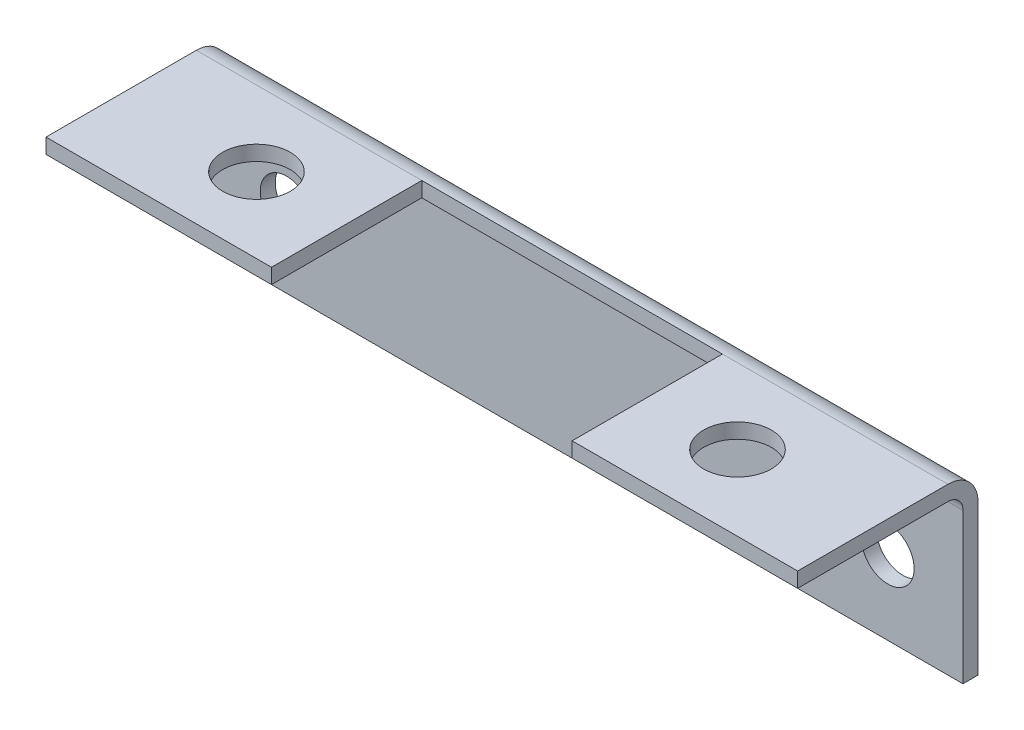
ISO-10303-21;
HEADER;
FILE_DESCRIPTION(('STEP AP214'),'2;1');
FILE_NAME('part.step','',(''),(''),'','','');
FILE_SCHEMA(('AUTOMOTIVE_DESIGN { 1 0 10303 214 1 1 1 1 }'));
ENDSEC;
DATA;
#1=APPLICATION_CONTEXT('core data for automotive mechanical design processes');
#2=APPLICATION_PROTOCOL_DEFINITION('international standard','automotive_design',2000,#1);
#3=PRODUCT_CONTEXT('',#1,'mechanical');
#4=PRODUCT('Part','Part','',(#3));
#5=PRODUCT_RELATED_PRODUCT_CATEGORY('part','',(#4));
#6=PRODUCT_DEFINITION_FORMATION('','',#4);
#7=PRODUCT_DEFINITION_CONTEXT('part definition',#1,'design');
#8=PRODUCT_DEFINITION('design','',#6,#7);
#9=PRODUCT_DEFINITION_SHAPE('','',#8);
#10=(LENGTH_UNIT() NAMED_UNIT(*) SI_UNIT(.MILLI.,.METRE.));
#11=(NAMED_UNIT(*) PLANE_ANGLE_UNIT() SI_UNIT($,.RADIAN.));
#12=(NAMED_UNIT(*) SI_UNIT($,.STERADIAN.) SOLID_ANGLE_UNIT());
#13=UNCERTAINTY_MEASURE_WITH_UNIT(LENGTH_MEASURE(1.E-05),#10,'distance_accuracy_value','');
#14=(GEOMETRIC_REPRESENTATION_CONTEXT(3) GLOBAL_UNCERTAINTY_ASSIGNED_CONTEXT((#13)) GLOBAL_UNIT_ASSIGNED_CONTEXT((#10,
#11,#12)) REPRESENTATION_CONTEXT('',''));
#15=CARTESIAN_POINT('',(0.,0.,0.));
#16=DIRECTION('',(0.,0.,1.));
#17=DIRECTION('',(1.,0.,0.));
#18=AXIS2_PLACEMENT_3D('',#15,#16,#17);
#19=CARTESIAN_POINT('',(0.,6.00000000000001,5.86902664470767));
#20=DIRECTION('',(0.,-1.,0.));
#21=DIRECTION('',(0.,0.,-1.));
#22=AXIS2_PLACEMENT_3D('',#19,#20,#21);
#23=PLANE('',#22);
#24=CARTESIAN_POINT('',(16.,6.00000000000001,7.));
#25=DIRECTION('',(0.,1.,0.));
#26=DIRECTION('',(0.,0.,1.));
#27=AXIS2_PLACEMENT_3D('',#24,#25,#26);
#28=CIRCLE('',#27,2.25);
#29=CARTESIAN_POINT('',(16.,6.00000000000001,9.25));
#30=VERTEX_POINT('',#29);
#31=EDGE_CURVE('E19',#30,#30,#28,.T.);
#32=ORIENTED_EDGE('',*,*,#31,.T.);
#33=EDGE_LOOP('',(#32));
#34=FACE_BOUND('',#33,.T.);
#35=DIRECTION('',(0.,0.,-1.));
#36=VECTOR('',#35,1.);
#37=CARTESIAN_POINT('',(25.,6.00000000000001,2.));
#38=LINE('',#37,#36);
#39=CARTESIAN_POINT('',(25.,6.00000000000001,12.));
#40=VERTEX_POINT('',#39);
#41=CARTESIAN_POINT('',(25.,6.00000000000001,2.));
#42=VERTEX_POINT('',#41);
#43=EDGE_CURVE('E59',#40,#42,#38,.T.);
#44=ORIENTED_EDGE('',*,*,#43,.F.);
#45=DIRECTION('',(1.,0.,0.));
#46=VECTOR('',#45,1.);
#47=CARTESIAN_POINT('',(25.,6.00000000000001,12.));
#48=LINE('',#47,#46);
#49=CARTESIAN_POINT('',(10.,6.00000000000001,12.));
#50=VERTEX_POINT('',#49);
#51=EDGE_CURVE('E68',#50,#40,#48,.T.);
#52=ORIENTED_EDGE('',*,*,#51,.F.);
#53=DIRECTION('',(0.,0.,-1.));
#54=VECTOR('',#53,1.);
#55=CARTESIAN_POINT('',(10.,6.00000000000001,2.));
#56=LINE('',#55,#54);
#57=CARTESIAN_POINT('',(10.,6.00000000000001,2.));
#58=VERTEX_POINT('',#57);
#59=EDGE_CURVE('E247',#50,#58,#56,.T.);
#60=ORIENTED_EDGE('',*,*,#59,.T.);
#61=DIRECTION('',(1.,0.,0.));
#62=VECTOR('',#61,1.);
#63=CARTESIAN_POINT('',(0.,6.00000000000001,2.));
#64=LINE('',#63,#62);
#65=EDGE_CURVE('E235',#58,#42,#64,.T.);
#66=ORIENTED_EDGE('',*,*,#65,.T.);
#67=EDGE_LOOP('',(#44,#52,#60,#66));
#68=FACE_BOUND('',#67,.T.);
#69=ADVANCED_FACE('F16',(#34,#68),#23,.T.);
#70=CARTESIAN_POINT('',(0.,6.00000000000001,5.86902664470767));
#71=DIRECTION('',(0.,-1.,0.));
#72=DIRECTION('',(0.,0.,-1.));
#73=AXIS2_PLACEMENT_3D('',#70,#71,#72);
#74=PLANE('',#73);
#75=CARTESIAN_POINT('',(-16.,6.00000000000001,7.));
#76=DIRECTION('',(0.,1.,0.));
#77=DIRECTION('',(0.,0.,1.));
#78=AXIS2_PLACEMENT_3D('',#75,#76,#77);
#79=CIRCLE('',#78,2.25);
#80=CARTESIAN_POINT('',(-16.,6.00000000000001,9.25));
#81=VERTEX_POINT('',#80);
#82=EDGE_CURVE('E224',#81,#81,#79,.T.);
#83=ORIENTED_EDGE('',*,*,#82,.T.);
#84=EDGE_LOOP('',(#83));
#85=FACE_BOUND('',#84,.T.);
#86=DIRECTION('',(0.,0.,1.));
#87=VECTOR('',#86,1.);
#88=CARTESIAN_POINT('',(-25.,6.00000000000001,2.));
#89=LINE('',#88,#87);
#90=CARTESIAN_POINT('',(-25.,6.00000000000001,2.));
#91=VERTEX_POINT('',#90);
#92=CARTESIAN_POINT('',(-25.,6.00000000000001,12.));
#93=VERTEX_POINT('',#92);
#94=EDGE_CURVE('E214',#91,#93,#89,.T.);
#95=ORIENTED_EDGE('',*,*,#94,.F.);
#96=DIRECTION('',(1.,0.,0.));
#97=VECTOR('',#96,1.);
#98=CARTESIAN_POINT('',(0.,6.00000000000001,2.));
#99=LINE('',#98,#97);
#100=CARTESIAN_POINT('',(-10.,6.00000000000001,2.));
#101=VERTEX_POINT('',#100);
#102=EDGE_CURVE('E181',#91,#101,#99,.T.);
#103=ORIENTED_EDGE('',*,*,#102,.T.);
#104=DIRECTION('',(0.,0.,1.));
#105=VECTOR('',#104,1.);
#106=CARTESIAN_POINT('',(-10.,6.00000000000001,12.));
#107=LINE('',#106,#105);
#108=CARTESIAN_POINT('',(-10.,6.00000000000001,12.));
#109=VERTEX_POINT('',#108);
#110=EDGE_CURVE('E225',#101,#109,#107,.T.);
#111=ORIENTED_EDGE('',*,*,#110,.T.);
#112=DIRECTION('',(1.,0.,0.));
#113=VECTOR('',#112,1.);
#114=CARTESIAN_POINT('',(25.,6.00000000000001,12.));
#115=LINE('',#114,#113);
#116=EDGE_CURVE('E118',#93,#109,#115,.T.);
#117=ORIENTED_EDGE('',*,*,#116,.F.);
#118=EDGE_LOOP('',(#95,#103,#111,#117));
#119=FACE_BOUND('',#118,.T.);
#120=ADVANCED_FACE('F301',(#85,#119),#74,.T.);
#121=CARTESIAN_POINT('',(25.,6.00000000000001,12.));
#122=DIRECTION('',(0.,0.,1.));
#123=DIRECTION('',(0.,-1.,0.));
#124=AXIS2_PLACEMENT_3D('',#121,#122,#123);
#125=PLANE('',#124);
#126=DIRECTION('',(0.,-1.,0.));
#127=VECTOR('',#126,1.);
#128=CARTESIAN_POINT('',(25.,6.00000000000001,12.));
#129=LINE('',#128,#127);
#130=CARTESIAN_POINT('',(25.,7.00000000000001,12.));
#131=VERTEX_POINT('',#130);
#132=EDGE_CURVE('E111',#40,#131,#129,.F.);
#133=ORIENTED_EDGE('',*,*,#132,.T.);
#134=DIRECTION('',(1.,0.,0.));
#135=VECTOR('',#134,1.);
#136=CARTESIAN_POINT('',(0.,7.00000000000001,12.));
#137=LINE('',#136,#135);
#138=CARTESIAN_POINT('',(10.,7.00000000000001,12.));
#139=VERTEX_POINT('',#138);
#140=EDGE_CURVE('E180',#131,#139,#137,.F.);
#141=ORIENTED_EDGE('',*,*,#140,.T.);
#142=DIRECTION('',(0.,1.,0.));
#143=VECTOR('',#142,1.);
#144=CARTESIAN_POINT('',(10.,7.00000000000001,12.));
#145=LINE('',#144,#143);
#146=EDGE_CURVE('E250',#139,#50,#145,.F.);
#147=ORIENTED_EDGE('',*,*,#146,.T.);
#148=ORIENTED_EDGE('',*,*,#51,.T.);
#149=EDGE_LOOP('',(#133,#141,#147,#148));
#150=FACE_BOUND('',#149,.T.);
#151=ADVANCED_FACE('F378',(#150),#125,.T.);
#152=CARTESIAN_POINT('',(10.,7.00000000000001,2.));
#153=DIRECTION('',(1.,0.,0.));
#154=DIRECTION('',(0.,0.,-1.));
#155=AXIS2_PLACEMENT_3D('',#152,#153,#154);
#156=PLANE('',#155);
#157=DIRECTION('',(0.,1.,0.));
#158=VECTOR('',#157,1.);
#159=CARTESIAN_POINT('',(10.,7.00000000000001,2.));
#160=LINE('',#159,#158);
#161=CARTESIAN_POINT('',(10.,7.00000000000001,2.));
#162=VERTEX_POINT('',#161);
#163=EDGE_CURVE('E98',#58,#162,#160,.T.);
#164=ORIENTED_EDGE('',*,*,#163,.F.);
#165=ORIENTED_EDGE('',*,*,#59,.F.);
#166=ORIENTED_EDGE('',*,*,#146,.F.);
#167=DIRECTION('',(0.,0.,-1.));
#168=VECTOR('',#167,1.);
#169=CARTESIAN_POINT('',(10.,7.00000000000001,5.86902664470767));
#170=LINE('',#169,#168);
#171=EDGE_CURVE('E184',#139,#162,#170,.T.);
#172=ORIENTED_EDGE('',*,*,#171,.T.);
#173=EDGE_LOOP('',(#164,#165,#166,#172));
#174=FACE_BOUND('',#173,.T.);
#175=ADVANCED_FACE('F377',(#174),#156,.F.);
#176=CARTESIAN_POINT('',(16.,6.00000000000001,7.));
#177=DIRECTION('',(0.,1.,0.));
#178=DIRECTION('',(0.,0.,1.));
#179=AXIS2_PLACEMENT_3D('',#176,#177,#178);
#180=CYLINDRICAL_SURFACE('',#179,2.25);
#181=CARTESIAN_POINT('',(16.,7.00000000000001,7.));
#182=DIRECTION('',(0.,1.,0.));
#183=DIRECTION('',(0.,0.,1.));
#184=AXIS2_PLACEMENT_3D('',#181,#182,#183);
#185=CIRCLE('',#184,2.25);
#186=CARTESIAN_POINT('',(16.,7.00000000000001,9.25));
#187=VERTEX_POINT('',#186);
#188=EDGE_CURVE('E186',#187,#187,#185,.T.);
#189=ORIENTED_EDGE('',*,*,#188,.T.);
#190=EDGE_LOOP('',(#189));
#191=FACE_BOUND('',#190,.T.);
#192=ORIENTED_EDGE('',*,*,#31,.F.);
#193=EDGE_LOOP('',(#192));
#194=FACE_BOUND('',#193,.T.);
#195=ADVANCED_FACE('F385',(#191,#194),#180,.F.);
#196=CARTESIAN_POINT('',(25.,6.00000000000001,12.));
#197=DIRECTION('',(0.,0.,1.));
#198=DIRECTION('',(0.,-1.,0.));
#199=AXIS2_PLACEMENT_3D('',#196,#197,#198);
#200=PLANE('',#199);
#201=DIRECTION('',(0.,1.,0.));
#202=VECTOR('',#201,1.);
#203=CARTESIAN_POINT('',(-25.,6.00000000000001,12.));
#204=LINE('',#203,#202);
#205=CARTESIAN_POINT('',(-25.,7.00000000000001,12.));
#206=VERTEX_POINT('',#205);
#207=EDGE_CURVE('E211',#93,#206,#204,.T.);
#208=ORIENTED_EDGE('',*,*,#207,.F.);
#209=ORIENTED_EDGE('',*,*,#116,.T.);
#210=DIRECTION('',(0.,1.,0.));
#211=VECTOR('',#210,1.);
#212=CARTESIAN_POINT('',(-10.,7.00000000000001,12.));
#213=LINE('',#212,#211);
#214=CARTESIAN_POINT('',(-10.,7.00000000000001,12.));
#215=VERTEX_POINT('',#214);
#216=EDGE_CURVE('E222',#109,#215,#213,.T.);
#217=ORIENTED_EDGE('',*,*,#216,.T.);
#218=DIRECTION('',(1.,0.,0.));
#219=VECTOR('',#218,1.);
#220=CARTESIAN_POINT('',(0.,7.00000000000001,12.));
#221=LINE('',#220,#219);
#222=EDGE_CURVE('E165',#215,#206,#221,.F.);
#223=ORIENTED_EDGE('',*,*,#222,.T.);
#224=EDGE_LOOP('',(#208,#209,#217,#223));
#225=FACE_BOUND('',#224,.T.);
#226=ADVANCED_FACE('F318',(#225),#200,.T.);
#227=CARTESIAN_POINT('',(-10.,7.00000000000001,12.));
#228=DIRECTION('',(-1.,0.,0.));
#229=DIRECTION('',(0.,0.,1.));
#230=AXIS2_PLACEMENT_3D('',#227,#228,#229);
#231=PLANE('',#230);
#232=ORIENTED_EDGE('',*,*,#216,.F.);
#233=ORIENTED_EDGE('',*,*,#110,.F.);
#234=DIRECTION('',(0.,1.,0.));
#235=VECTOR('',#234,1.);
#236=CARTESIAN_POINT('',(-10.,7.00000000000001,2.));
#237=LINE('',#236,#235);
#238=CARTESIAN_POINT('',(-10.,7.00000000000001,2.));
#239=VERTEX_POINT('',#238);
#240=EDGE_CURVE('E213',#239,#101,#237,.F.);
#241=ORIENTED_EDGE('',*,*,#240,.F.);
#242=DIRECTION('',(0.,0.,-1.));
#243=VECTOR('',#242,1.);
#244=CARTESIAN_POINT('',(-10.,7.00000000000001,5.86902664470767));
#245=LINE('',#244,#243);
#246=EDGE_CURVE('E164',#239,#215,#245,.F.);
#247=ORIENTED_EDGE('',*,*,#246,.T.);
#248=EDGE_LOOP('',(#232,#233,#241,#247));
#249=FACE_BOUND('',#248,.T.);
#250=ADVANCED_FACE('F307',(#249),#231,.F.);
#251=CARTESIAN_POINT('',(-16.,6.00000000000001,7.));
#252=DIRECTION('',(0.,1.,0.));
#253=DIRECTION('',(0.,0.,1.));
#254=AXIS2_PLACEMENT_3D('',#251,#252,#253);
#255=CYLINDRICAL_SURFACE('',#254,2.25);
#256=CARTESIAN_POINT('',(-16.,7.00000000000001,7.));
#257=DIRECTION('',(0.,1.,0.));
#258=DIRECTION('',(0.,0.,1.));
#259=AXIS2_PLACEMENT_3D('',#256,#257,#258);
#260=CIRCLE('',#259,2.25);
#261=CARTESIAN_POINT('',(-16.,7.00000000000001,9.25));
#262=VERTEX_POINT('',#261);
#263=EDGE_CURVE('E230',#262,#262,#260,.T.);
#264=ORIENTED_EDGE('',*,*,#263,.T.);
#265=EDGE_LOOP('',(#264));
#266=FACE_BOUND('',#265,.T.);
#267=ORIENTED_EDGE('',*,*,#82,.F.);
#268=EDGE_LOOP('',(#267));
#269=FACE_BOUND('',#268,.T.);
#270=ADVANCED_FACE('F304',(#266,#269),#255,.F.);
#271=CARTESIAN_POINT('',(0.,5.00000000000001,2.));
#272=DIRECTION('',(1.,0.,0.));
#273=DIRECTION('',(0.,0.,-1.));
#274=AXIS2_PLACEMENT_3D('',#271,#272,#273);
#275=CYLINDRICAL_SURFACE('',#274,0.999999999999999);
#276=CARTESIAN_POINT('',(-25.,5.00000000000001,2.));
#277=DIRECTION('',(1.,0.,0.));
#278=DIRECTION('',(0.,0.,-1.));
#279=AXIS2_PLACEMENT_3D('',#276,#277,#278);
#280=CIRCLE('',#279,0.999999999999999);
#281=CARTESIAN_POINT('',(-25.,5.00000000000001,1.));
#282=VERTEX_POINT('',#281);
#283=EDGE_CURVE('E219',#282,#91,#280,.T.);
#284=ORIENTED_EDGE('',*,*,#283,.F.);
#285=DIRECTION('',(1.,0.,0.));
#286=VECTOR('',#285,1.);
#287=CARTESIAN_POINT('',(0.,5.00000000000001,1.));
#288=LINE('',#287,#286);
#289=CARTESIAN_POINT('',(25.,5.00000000000001,1.));
#290=VERTEX_POINT('',#289);
#291=EDGE_CURVE('E196',#290,#282,#288,.F.);
#292=ORIENTED_EDGE('',*,*,#291,.F.);
#293=CARTESIAN_POINT('',(25.,5.00000000000001,2.));
#294=DIRECTION('',(1.,0.,0.));
#295=DIRECTION('',(0.,0.,-1.));
#296=AXIS2_PLACEMENT_3D('',#293,#294,#295);
#297=CIRCLE('',#296,0.999999999999999);
#298=EDGE_CURVE('E295',#42,#290,#297,.F.);
#299=ORIENTED_EDGE('',*,*,#298,.F.);
#300=ORIENTED_EDGE('',*,*,#65,.F.);
#301=DIRECTION('',(-1.,0.,0.));
#302=VECTOR('',#301,1.);
#303=CARTESIAN_POINT('',(-10.,6.00000000000001,2.));
#304=LINE('',#303,#302);
#305=EDGE_CURVE('E199',#58,#101,#304,.T.);
#306=ORIENTED_EDGE('',*,*,#305,.T.);
#307=ORIENTED_EDGE('',*,*,#102,.F.);
#308=EDGE_LOOP('',(#284,#292,#299,#300,#306,#307));
#309=FACE_BOUND('',#308,.T.);
#310=ADVANCED_FACE('F306',(#309),#275,.F.);
#311=CARTESIAN_POINT('',(0.,7.00000000000001,5.86902664470767));
#312=DIRECTION('',(0.,-1.,0.));
#313=DIRECTION('',(0.,0.,-1.));
#314=AXIS2_PLACEMENT_3D('',#311,#312,#313);
#315=PLANE('',#314);
#316=ORIENTED_EDGE('',*,*,#188,.F.);
#317=EDGE_LOOP('',(#316));
#318=FACE_BOUND('',#317,.T.);
#319=ORIENTED_EDGE('',*,*,#140,.F.);
#320=DIRECTION('',(0.,0.,-1.));
#321=VECTOR('',#320,1.);
#322=CARTESIAN_POINT('',(25.,7.00000000000001,5.86902664470767));
#323=LINE('',#322,#321);
#324=CARTESIAN_POINT('',(25.,7.00000000000001,2.));
#325=VERTEX_POINT('',#324);
#326=EDGE_CURVE('E90',#325,#131,#323,.F.);
#327=ORIENTED_EDGE('',*,*,#326,.F.);
#328=DIRECTION('',(1.,0.,0.));
#329=VECTOR('',#328,1.);
#330=CARTESIAN_POINT('',(0.,7.00000000000001,2.));
#331=LINE('',#330,#329);
#332=EDGE_CURVE('E173',#162,#325,#331,.T.);
#333=ORIENTED_EDGE('',*,*,#332,.F.);
#334=ORIENTED_EDGE('',*,*,#171,.F.);
#335=EDGE_LOOP('',(#319,#327,#333,#334));
#336=FACE_BOUND('',#335,.T.);
#337=ADVANCED_FACE('F315',(#318,#336),#315,.F.);
#338=CARTESIAN_POINT('',(0.,7.00000000000001,5.86902664470767));
#339=DIRECTION('',(0.,-1.,0.));
#340=DIRECTION('',(0.,0.,-1.));
#341=AXIS2_PLACEMENT_3D('',#338,#339,#340);
#342=PLANE('',#341);
#343=ORIENTED_EDGE('',*,*,#263,.F.);
#344=EDGE_LOOP('',(#343));
#345=FACE_BOUND('',#344,.T.);
#346=DIRECTION('',(1.,0.,0.));
#347=VECTOR('',#346,1.);
#348=CARTESIAN_POINT('',(0.,7.00000000000001,2.));
#349=LINE('',#348,#347);
#350=CARTESIAN_POINT('',(-25.,7.00000000000001,2.));
#351=VERTEX_POINT('',#350);
#352=EDGE_CURVE('E168',#351,#239,#349,.T.);
#353=ORIENTED_EDGE('',*,*,#352,.F.);
#354=DIRECTION('',(0.,0.,-1.));
#355=VECTOR('',#354,1.);
#356=CARTESIAN_POINT('',(-25.,7.00000000000001,5.86902664470767));
#357=LINE('',#356,#355);
#358=EDGE_CURVE('E162',#206,#351,#357,.T.);
#359=ORIENTED_EDGE('',*,*,#358,.F.);
#360=ORIENTED_EDGE('',*,*,#222,.F.);
#361=ORIENTED_EDGE('',*,*,#246,.F.);
#362=EDGE_LOOP('',(#353,#359,#360,#361));
#363=FACE_BOUND('',#362,.T.);
#364=ADVANCED_FACE('F354',(#345,#363),#342,.F.);
#365=CARTESIAN_POINT('',(-10.,7.00000000000001,2.));
#366=DIRECTION('',(0.,0.,-1.));
#367=DIRECTION('',(-1.,0.,0.));
#368=AXIS2_PLACEMENT_3D('',#365,#366,#367);
#369=PLANE('',#368);
#370=ORIENTED_EDGE('',*,*,#240,.T.);
#371=ORIENTED_EDGE('',*,*,#305,.F.);
#372=ORIENTED_EDGE('',*,*,#163,.T.);
#373=DIRECTION('',(1.,0.,0.));
#374=VECTOR('',#373,1.);
#375=CARTESIAN_POINT('',(0.,7.00000000000001,2.));
#376=LINE('',#375,#374);
#377=EDGE_CURVE('E170',#239,#162,#376,.T.);
#378=ORIENTED_EDGE('',*,*,#377,.F.);
#379=EDGE_LOOP('',(#370,#371,#372,#378));
#380=FACE_BOUND('',#379,.T.);
#381=ADVANCED_FACE('F350',(#380),#369,.F.);
#382=CARTESIAN_POINT('',(0.,0.,1.));
#383=DIRECTION('',(0.,0.,1.));
#384=DIRECTION('',(1.,0.,0.));
#385=AXIS2_PLACEMENT_3D('',#382,#383,#384);
#386=PLANE('',#385);
#387=CARTESIAN_POINT('',(-20.,0.,1.));
#388=DIRECTION('',(0.,0.,1.));
#389=DIRECTION('',(1.,0.,0.));
#390=AXIS2_PLACEMENT_3D('',#387,#388,#389);
#391=CIRCLE('',#390,1.75);
#392=CARTESIAN_POINT('',(-18.25,0.,1.));
#393=VERTEX_POINT('',#392);
#394=EDGE_CURVE('E154',#393,#393,#391,.F.);
#395=ORIENTED_EDGE('',*,*,#394,.T.);
#396=EDGE_LOOP('',(#395));
#397=FACE_BOUND('',#396,.T.);
#398=CARTESIAN_POINT('',(20.,0.,1.));
#399=DIRECTION('',(0.,0.,1.));
#400=DIRECTION('',(1.,0.,0.));
#401=AXIS2_PLACEMENT_3D('',#398,#399,#400);
#402=CIRCLE('',#401,1.75);
#403=CARTESIAN_POINT('',(21.75,0.,1.));
#404=VERTEX_POINT('',#403);
#405=EDGE_CURVE('E157',#404,#404,#402,.F.);
#406=ORIENTED_EDGE('',*,*,#405,.T.);
#407=EDGE_LOOP('',(#406));
#408=FACE_BOUND('',#407,.T.);
#409=DIRECTION('',(0.,1.,0.));
#410=VECTOR('',#409,1.);
#411=CARTESIAN_POINT('',(-25.,-5.,1.));
#412=LINE('',#411,#410);
#413=CARTESIAN_POINT('',(-25.,-5.,1.));
#414=VERTEX_POINT('',#413);
#415=EDGE_CURVE('E198',#414,#282,#412,.T.);
#416=ORIENTED_EDGE('',*,*,#415,.F.);
#417=DIRECTION('',(1.,0.,0.));
#418=VECTOR('',#417,1.);
#419=CARTESIAN_POINT('',(25.,-4.99999999999999,1.));
#420=LINE('',#419,#418);
#421=CARTESIAN_POINT('',(25.,-4.99999999999999,1.));
#422=VERTEX_POINT('',#421);
#423=EDGE_CURVE('E139',#422,#414,#420,.F.);
#424=ORIENTED_EDGE('',*,*,#423,.F.);
#425=DIRECTION('',(0.,1.,0.));
#426=VECTOR('',#425,1.);
#427=CARTESIAN_POINT('',(25.,5.00000000000001,1.));
#428=LINE('',#427,#426);
#429=EDGE_CURVE('E144',#290,#422,#428,.F.);
#430=ORIENTED_EDGE('',*,*,#429,.F.);
#431=ORIENTED_EDGE('',*,*,#291,.T.);
#432=EDGE_LOOP('',(#416,#424,#430,#431));
#433=FACE_BOUND('',#432,.T.);
#434=ADVANCED_FACE('F347',(#397,#408,#433),#386,.T.);
#435=CARTESIAN_POINT('',(-25.,-5.,0.));
#436=DIRECTION('',(-1.,0.,0.));
#437=DIRECTION('',(0.,0.,1.));
#438=AXIS2_PLACEMENT_3D('',#435,#436,#437);
#439=PLANE('',#438);
#440=DIRECTION('',(0.,1.,0.));
#441=VECTOR('',#440,1.);
#442=CARTESIAN_POINT('',(-25.,0.,0.));
#443=LINE('',#442,#441);
#444=CARTESIAN_POINT('',(-25.,5.00000000000001,0.));
#445=VERTEX_POINT('',#444);
#446=CARTESIAN_POINT('',(-25.,-5.,0.));
#447=VERTEX_POINT('',#446);
#448=EDGE_CURVE('E149',#445,#447,#443,.F.);
#449=ORIENTED_EDGE('',*,*,#448,.T.);
#450=DIRECTION('',(0.,0.,1.));
#451=VECTOR('',#450,1.);
#452=CARTESIAN_POINT('',(-25.,-5.,0.));
#453=LINE('',#452,#451);
#454=EDGE_CURVE('E133',#414,#447,#453,.F.);
#455=ORIENTED_EDGE('',*,*,#454,.F.);
#456=ORIENTED_EDGE('',*,*,#415,.T.);
#457=ORIENTED_EDGE('',*,*,#283,.T.);
#458=ORIENTED_EDGE('',*,*,#94,.T.);
#459=ORIENTED_EDGE('',*,*,#207,.T.);
#460=ORIENTED_EDGE('',*,*,#358,.T.);
#461=CARTESIAN_POINT('',(-25.,5.00000000000001,2.));
#462=DIRECTION('',(1.,0.,0.));
#463=DIRECTION('',(0.,0.,-1.));
#464=AXIS2_PLACEMENT_3D('',#461,#462,#463);
#465=CIRCLE('',#464,2.);
#466=EDGE_CURVE('E80',#445,#351,#465,.T.);
#467=ORIENTED_EDGE('',*,*,#466,.F.);
#468=EDGE_LOOP('',(#449,#455,#456,#457,#458,#459,#460,#467));
#469=FACE_BOUND('',#468,.T.);
#470=ADVANCED_FACE('F153',(#469),#439,.T.);
#471=CARTESIAN_POINT('',(25.,-4.99999999999999,0.));
#472=DIRECTION('',(0.,-1.,0.));
#473=DIRECTION('',(1.,0.,0.));
#474=AXIS2_PLACEMENT_3D('',#471,#472,#473);
#475=PLANE('',#474);
#476=DIRECTION('',(1.,0.,0.));
#477=VECTOR('',#476,1.);
#478=CARTESIAN_POINT('',(0.,-5.,0.));
#479=LINE('',#478,#477);
#480=CARTESIAN_POINT('',(25.,-4.99999999999999,0.));
#481=VERTEX_POINT('',#480);
#482=EDGE_CURVE('E137',#447,#481,#479,.T.);
#483=ORIENTED_EDGE('',*,*,#482,.T.);
#484=DIRECTION('',(0.,0.,-1.));
#485=VECTOR('',#484,1.);
#486=CARTESIAN_POINT('',(25.,-4.99999999999999,0.));
#487=LINE('',#486,#485);
#488=EDGE_CURVE('E175',#422,#481,#487,.T.);
#489=ORIENTED_EDGE('',*,*,#488,.F.);
#490=ORIENTED_EDGE('',*,*,#423,.T.);
#491=ORIENTED_EDGE('',*,*,#454,.T.);
#492=EDGE_LOOP('',(#483,#489,#490,#491));
#493=FACE_BOUND('',#492,.T.);
#494=ADVANCED_FACE('F135',(#493),#475,.T.);
#495=CARTESIAN_POINT('',(25.,5.00000000000001,0.));
#496=DIRECTION('',(1.,0.,0.));
#497=DIRECTION('',(0.,0.,-1.));
#498=AXIS2_PLACEMENT_3D('',#495,#496,#497);
#499=PLANE('',#498);
#500=DIRECTION('',(0.,1.,0.));
#501=VECTOR('',#500,1.);
#502=CARTESIAN_POINT('',(25.,0.,0.));
#503=LINE('',#502,#501);
#504=CARTESIAN_POINT('',(25.,5.00000000000001,0.));
#505=VERTEX_POINT('',#504);
#506=EDGE_CURVE('E151',#481,#505,#503,.T.);
#507=ORIENTED_EDGE('',*,*,#506,.T.);
#508=CARTESIAN_POINT('',(25.,5.00000000000001,2.));
#509=DIRECTION('',(1.,0.,0.));
#510=DIRECTION('',(0.,0.,-1.));
#511=AXIS2_PLACEMENT_3D('',#508,#509,#510);
#512=CIRCLE('',#511,2.);
#513=EDGE_CURVE('E34',#325,#505,#512,.F.);
#514=ORIENTED_EDGE('',*,*,#513,.F.);
#515=ORIENTED_EDGE('',*,*,#326,.T.);
#516=ORIENTED_EDGE('',*,*,#132,.F.);
#517=ORIENTED_EDGE('',*,*,#43,.T.);
#518=ORIENTED_EDGE('',*,*,#298,.T.);
#519=ORIENTED_EDGE('',*,*,#429,.T.);
#520=ORIENTED_EDGE('',*,*,#488,.T.);
#521=EDGE_LOOP('',(#507,#514,#515,#516,#517,#518,#519,#520));
#522=FACE_BOUND('',#521,.T.);
#523=ADVANCED_FACE('F340',(#522),#499,.T.);
#524=CARTESIAN_POINT('',(0.,5.00000000000001,2.));
#525=DIRECTION('',(1.,0.,0.));
#526=DIRECTION('',(0.,0.,-1.));
#527=AXIS2_PLACEMENT_3D('',#524,#525,#526);
#528=CYLINDRICAL_SURFACE('',#527,2.);
#529=ORIENTED_EDGE('',*,*,#352,.T.);
#530=ORIENTED_EDGE('',*,*,#377,.T.);
#531=ORIENTED_EDGE('',*,*,#332,.T.);
#532=ORIENTED_EDGE('',*,*,#513,.T.);
#533=DIRECTION('',(1.,0.,0.));
#534=VECTOR('',#533,1.);
#535=CARTESIAN_POINT('',(0.,5.00000000000001,0.));
#536=LINE('',#535,#534);
#537=EDGE_CURVE('E160',#505,#445,#536,.F.);
#538=ORIENTED_EDGE('',*,*,#537,.T.);
#539=ORIENTED_EDGE('',*,*,#466,.T.);
#540=EDGE_LOOP('',(#529,#530,#531,#532,#538,#539));
#541=FACE_BOUND('',#540,.T.);
#542=ADVANCED_FACE('F336',(#541),#528,.T.);
#543=CARTESIAN_POINT('',(20.,0.,0.));
#544=DIRECTION('',(0.,0.,1.));
#545=DIRECTION('',(1.,0.,0.));
#546=AXIS2_PLACEMENT_3D('',#543,#544,#545);
#547=CYLINDRICAL_SURFACE('',#546,1.75);
#548=ORIENTED_EDGE('',*,*,#405,.F.);
#549=EDGE_LOOP('',(#548));
#550=FACE_BOUND('',#549,.T.);
#551=CARTESIAN_POINT('',(20.,0.,0.));
#552=DIRECTION('',(0.,0.,1.));
#553=DIRECTION('',(1.,0.,0.));
#554=AXIS2_PLACEMENT_3D('',#551,#552,#553);
#555=CIRCLE('',#554,1.75);
#556=CARTESIAN_POINT('',(21.75,0.,0.));
#557=VERTEX_POINT('',#556);
#558=EDGE_CURVE('E25',#557,#557,#555,.F.);
#559=ORIENTED_EDGE('',*,*,#558,.T.);
#560=EDGE_LOOP('',(#559));
#561=FACE_BOUND('',#560,.T.);
#562=ADVANCED_FACE('F328',(#550,#561),#547,.F.);
#563=CARTESIAN_POINT('',(-20.,0.,0.));
#564=DIRECTION('',(0.,0.,1.));
#565=DIRECTION('',(1.,0.,0.));
#566=AXIS2_PLACEMENT_3D('',#563,#564,#565);
#567=CYLINDRICAL_SURFACE('',#566,1.75);
#568=ORIENTED_EDGE('',*,*,#394,.F.);
#569=EDGE_LOOP('',(#568));
#570=FACE_BOUND('',#569,.T.);
#571=CARTESIAN_POINT('',(-20.,0.,0.));
#572=DIRECTION('',(0.,0.,1.));
#573=DIRECTION('',(1.,0.,0.));
#574=AXIS2_PLACEMENT_3D('',#571,#572,#573);
#575=CIRCLE('',#574,1.75);
#576=CARTESIAN_POINT('',(-18.25,0.,0.));
#577=VERTEX_POINT('',#576);
#578=EDGE_CURVE('E11',#577,#577,#575,.F.);
#579=ORIENTED_EDGE('',*,*,#578,.T.);
#580=EDGE_LOOP('',(#579));
#581=FACE_BOUND('',#580,.T.);
#582=ADVANCED_FACE('F322',(#570,#581),#567,.F.);
#583=CARTESIAN_POINT('',(0.,0.,0.));
#584=DIRECTION('',(0.,0.,1.));
#585=DIRECTION('',(1.,0.,0.));
#586=AXIS2_PLACEMENT_3D('',#583,#584,#585);
#587=PLANE('',#586);
#588=ORIENTED_EDGE('',*,*,#578,.F.);
#589=EDGE_LOOP('',(#588));
#590=FACE_BOUND('',#589,.T.);
#591=ORIENTED_EDGE('',*,*,#558,.F.);
#592=EDGE_LOOP('',(#591));
#593=FACE_BOUND('',#592,.T.);
#594=ORIENTED_EDGE('',*,*,#506,.F.);
#595=ORIENTED_EDGE('',*,*,#482,.F.);
#596=ORIENTED_EDGE('',*,*,#448,.F.);
#597=ORIENTED_EDGE('',*,*,#537,.F.);
#598=EDGE_LOOP('',(#594,#595,#596,#597));
#599=FACE_BOUND('',#598,.T.);
#600=ADVANCED_FACE('F148',(#590,#593,#599),#587,.F.);
#601=CLOSED_SHELL('',(#69,#120,#151,#175,#195,#226,#250,#270,#310,#337,#364,#381,#434,#470,#494,
#523,#542,#562,#582,#600));
#602=MANIFOLD_SOLID_BREP('B1',#601);
#603=ADVANCED_BREP_SHAPE_REPRESENTATION('',(#18,#602),#14);
#604=SHAPE_DEFINITION_REPRESENTATION(#9,#603);
ENDSEC;
END-ISO-10303-21;
